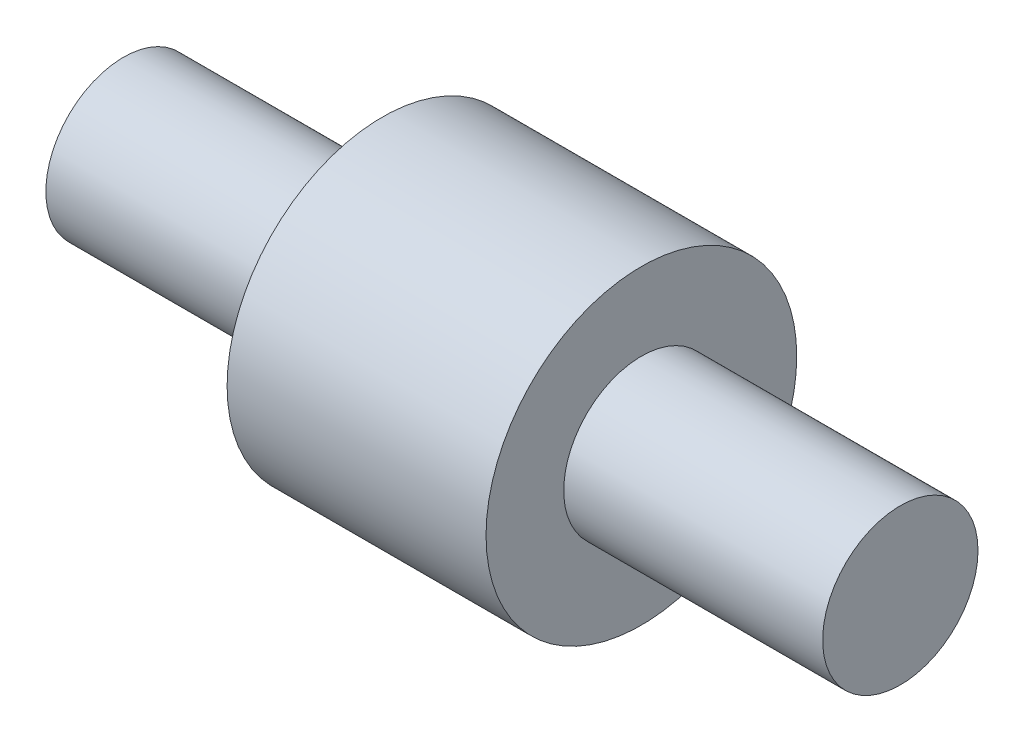
ISO-10303-21;
HEADER;
FILE_DESCRIPTION(('STEP AP214'),'2;1');
FILE_NAME('part.step','',(''),(''),'','','');
FILE_SCHEMA(('AUTOMOTIVE_DESIGN { 1 0 10303 214 1 1 1 1 }'));
ENDSEC;
DATA;
#1=APPLICATION_CONTEXT('core data for automotive mechanical design processes');
#2=APPLICATION_PROTOCOL_DEFINITION('international standard','automotive_design',2000,#1);
#3=PRODUCT_CONTEXT('',#1,'mechanical');
#4=PRODUCT('Part','Part','',(#3));
#5=PRODUCT_RELATED_PRODUCT_CATEGORY('part','',(#4));
#6=PRODUCT_DEFINITION_FORMATION('','',#4);
#7=PRODUCT_DEFINITION_CONTEXT('part definition',#1,'design');
#8=PRODUCT_DEFINITION('design','',#6,#7);
#9=PRODUCT_DEFINITION_SHAPE('','',#8);
#10=(LENGTH_UNIT() NAMED_UNIT(*) SI_UNIT(.MILLI.,.METRE.));
#11=(NAMED_UNIT(*) PLANE_ANGLE_UNIT() SI_UNIT($,.RADIAN.));
#12=(NAMED_UNIT(*) SI_UNIT($,.STERADIAN.) SOLID_ANGLE_UNIT());
#13=UNCERTAINTY_MEASURE_WITH_UNIT(LENGTH_MEASURE(1.E-05),#10,'distance_accuracy_value','');
#14=(GEOMETRIC_REPRESENTATION_CONTEXT(3) GLOBAL_UNCERTAINTY_ASSIGNED_CONTEXT((#13)) GLOBAL_UNIT_ASSIGNED_CONTEXT((#10,
#11,#12)) REPRESENTATION_CONTEXT('',''));
#15=CARTESIAN_POINT('',(0.,0.,0.));
#16=DIRECTION('',(0.,0.,1.));
#17=DIRECTION('',(1.,0.,0.));
#18=AXIS2_PLACEMENT_3D('',#15,#16,#17);
#19=CARTESIAN_POINT('',(0.,0.,0.));
#20=DIRECTION('',(-1.,0.,0.));
#21=DIRECTION('',(0.,0.,1.));
#22=AXIS2_PLACEMENT_3D('',#19,#20,#21);
#23=PLANE('',#22);
#24=CARTESIAN_POINT('',(0.,0.,0.));
#25=DIRECTION('',(1.,0.,0.));
#26=DIRECTION('',(0.,0.,-1.));
#27=AXIS2_PLACEMENT_3D('',#24,#25,#26);
#28=CIRCLE('',#27,1.5);
#29=CARTESIAN_POINT('',(0.,0.,-1.5));
#30=VERTEX_POINT('',#29);
#31=EDGE_CURVE('E10',#30,#30,#28,.T.);
#32=ORIENTED_EDGE('',*,*,#31,.F.);
#33=EDGE_LOOP('',(#32));
#34=FACE_BOUND('',#33,.T.);
#35=ADVANCED_FACE('F33',(#34),#23,.T.);
#36=CARTESIAN_POINT('',(15.,0.,0.));
#37=DIRECTION('',(1.,0.,0.));
#38=DIRECTION('',(0.,0.,-1.));
#39=AXIS2_PLACEMENT_3D('',#36,#37,#38);
#40=CYLINDRICAL_SURFACE('',#39,1.5);
#41=ORIENTED_EDGE('',*,*,#31,.T.);
#42=EDGE_LOOP('',(#41));
#43=FACE_BOUND('',#42,.T.);
#44=CARTESIAN_POINT('',(5.,0.,0.));
#45=DIRECTION('',(1.,0.,0.));
#46=DIRECTION('',(0.,0.,-1.));
#47=AXIS2_PLACEMENT_3D('',#44,#45,#46);
#48=CIRCLE('',#47,1.5);
#49=CARTESIAN_POINT('',(5.,0.,-1.5));
#50=VERTEX_POINT('',#49);
#51=EDGE_CURVE('E39',#50,#50,#48,.T.);
#52=ORIENTED_EDGE('',*,*,#51,.F.);
#53=EDGE_LOOP('',(#52));
#54=FACE_BOUND('',#53,.T.);
#55=ADVANCED_FACE('F75',(#43,#54),#40,.T.);
#56=CARTESIAN_POINT('',(5.,1.5,0.));
#57=DIRECTION('',(-1.,0.,0.));
#58=DIRECTION('',(0.,0.,1.));
#59=AXIS2_PLACEMENT_3D('',#56,#57,#58);
#60=PLANE('',#59);
#61=ORIENTED_EDGE('',*,*,#51,.T.);
#62=EDGE_LOOP('',(#61));
#63=FACE_BOUND('',#62,.T.);
#64=CARTESIAN_POINT('',(5.,0.,0.));
#65=DIRECTION('',(1.,0.,0.));
#66=DIRECTION('',(0.,0.,-1.));
#67=AXIS2_PLACEMENT_3D('',#64,#65,#66);
#68=CIRCLE('',#67,3.);
#69=CARTESIAN_POINT('',(5.,0.,-3.));
#70=VERTEX_POINT('',#69);
#71=EDGE_CURVE('E43',#70,#70,#68,.T.);
#72=ORIENTED_EDGE('',*,*,#71,.F.);
#73=EDGE_LOOP('',(#72));
#74=FACE_BOUND('',#73,.T.);
#75=ADVANCED_FACE('F80',(#63,#74),#60,.T.);
#76=CARTESIAN_POINT('',(15.,0.,0.));
#77=DIRECTION('',(1.,0.,0.));
#78=DIRECTION('',(0.,0.,-1.));
#79=AXIS2_PLACEMENT_3D('',#76,#77,#78);
#80=CYLINDRICAL_SURFACE('',#79,3.);
#81=ORIENTED_EDGE('',*,*,#71,.T.);
#82=EDGE_LOOP('',(#81));
#83=FACE_BOUND('',#82,.T.);
#84=CARTESIAN_POINT('',(10.,0.,0.));
#85=DIRECTION('',(1.,0.,0.));
#86=DIRECTION('',(0.,0.,-1.));
#87=AXIS2_PLACEMENT_3D('',#84,#85,#86);
#88=CIRCLE('',#87,3.);
#89=CARTESIAN_POINT('',(10.,0.,-3.));
#90=VERTEX_POINT('',#89);
#91=EDGE_CURVE('E47',#90,#90,#88,.T.);
#92=ORIENTED_EDGE('',*,*,#91,.F.);
#93=EDGE_LOOP('',(#92));
#94=FACE_BOUND('',#93,.T.);
#95=ADVANCED_FACE('F71',(#83,#94),#80,.T.);
#96=CARTESIAN_POINT('',(10.,3.,0.));
#97=DIRECTION('',(1.,0.,0.));
#98=DIRECTION('',(0.,0.,-1.));
#99=AXIS2_PLACEMENT_3D('',#96,#97,#98);
#100=PLANE('',#99);
#101=ORIENTED_EDGE('',*,*,#91,.T.);
#102=EDGE_LOOP('',(#101));
#103=FACE_BOUND('',#102,.T.);
#104=CARTESIAN_POINT('',(10.,0.,0.));
#105=DIRECTION('',(1.,0.,0.));
#106=DIRECTION('',(0.,0.,-1.));
#107=AXIS2_PLACEMENT_3D('',#104,#105,#106);
#108=CIRCLE('',#107,1.5);
#109=CARTESIAN_POINT('',(10.,0.,-1.5));
#110=VERTEX_POINT('',#109);
#111=EDGE_CURVE('E52',#110,#110,#108,.T.);
#112=ORIENTED_EDGE('',*,*,#111,.F.);
#113=EDGE_LOOP('',(#112));
#114=FACE_BOUND('',#113,.T.);
#115=ADVANCED_FACE('F63',(#103,#114),#100,.T.);
#116=CARTESIAN_POINT('',(15.,0.,0.));
#117=DIRECTION('',(1.,0.,0.));
#118=DIRECTION('',(0.,0.,-1.));
#119=AXIS2_PLACEMENT_3D('',#116,#117,#118);
#120=CYLINDRICAL_SURFACE('',#119,1.5);
#121=ORIENTED_EDGE('',*,*,#111,.T.);
#122=EDGE_LOOP('',(#121));
#123=FACE_BOUND('',#122,.T.);
#124=CARTESIAN_POINT('',(15.,0.,0.));
#125=DIRECTION('',(1.,0.,0.));
#126=DIRECTION('',(0.,0.,-1.));
#127=AXIS2_PLACEMENT_3D('',#124,#125,#126);
#128=CIRCLE('',#127,1.5);
#129=CARTESIAN_POINT('',(15.,0.,-1.5));
#130=VERTEX_POINT('',#129);
#131=EDGE_CURVE('E55',#130,#130,#128,.T.);
#132=ORIENTED_EDGE('',*,*,#131,.F.);
#133=EDGE_LOOP('',(#132));
#134=FACE_BOUND('',#133,.T.);
#135=ADVANCED_FACE('F61',(#123,#134),#120,.T.);
#136=CARTESIAN_POINT('',(15.,1.5,0.));
#137=DIRECTION('',(1.,0.,0.));
#138=DIRECTION('',(0.,0.,-1.));
#139=AXIS2_PLACEMENT_3D('',#136,#137,#138);
#140=PLANE('',#139);
#141=ORIENTED_EDGE('',*,*,#131,.T.);
#142=EDGE_LOOP('',(#141));
#143=FACE_BOUND('',#142,.T.);
#144=ADVANCED_FACE('F59',(#143),#140,.T.);
#145=CLOSED_SHELL('',(#35,#55,#75,#95,#115,#135,#144));
#146=MANIFOLD_SOLID_BREP('B2',#145);
#147=ADVANCED_BREP_SHAPE_REPRESENTATION('',(#18,#146),#14);
#148=SHAPE_DEFINITION_REPRESENTATION(#9,#147);
ENDSEC;
END-ISO-10303-21;
